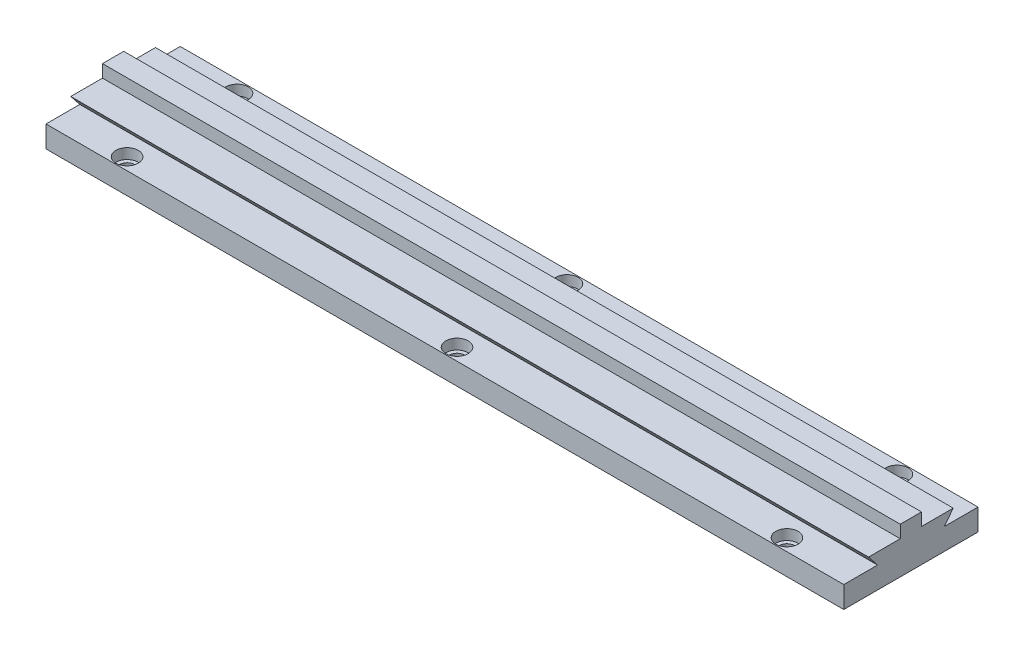
ISO-10303-21;
HEADER;
FILE_DESCRIPTION(('STEP AP214'),'2;1');
FILE_NAME('part.step','',(''),(''),'','','');
FILE_SCHEMA(('AUTOMOTIVE_DESIGN { 1 0 10303 214 1 1 1 1 }'));
ENDSEC;
DATA;
#1=APPLICATION_CONTEXT('core data for automotive mechanical design processes');
#2=APPLICATION_PROTOCOL_DEFINITION('international standard','automotive_design',2000,#1);
#3=PRODUCT_CONTEXT('',#1,'mechanical');
#4=PRODUCT('Part','Part','',(#3));
#5=PRODUCT_RELATED_PRODUCT_CATEGORY('part','',(#4));
#6=PRODUCT_DEFINITION_FORMATION('','',#4);
#7=PRODUCT_DEFINITION_CONTEXT('part definition',#1,'design');
#8=PRODUCT_DEFINITION('design','',#6,#7);
#9=PRODUCT_DEFINITION_SHAPE('','',#8);
#10=(LENGTH_UNIT() NAMED_UNIT(*) SI_UNIT(.MILLI.,.METRE.));
#11=(NAMED_UNIT(*) PLANE_ANGLE_UNIT() SI_UNIT($,.RADIAN.));
#12=(NAMED_UNIT(*) SI_UNIT($,.STERADIAN.) SOLID_ANGLE_UNIT());
#13=UNCERTAINTY_MEASURE_WITH_UNIT(LENGTH_MEASURE(1.E-05),#10,'distance_accuracy_value','');
#14=(GEOMETRIC_REPRESENTATION_CONTEXT(3) GLOBAL_UNCERTAINTY_ASSIGNED_CONTEXT((#13)) GLOBAL_UNIT_ASSIGNED_CONTEXT((#10,
#11,#12)) REPRESENTATION_CONTEXT('',''));
#15=CARTESIAN_POINT('',(0.,0.,0.));
#16=DIRECTION('',(0.,0.,1.));
#17=DIRECTION('',(1.,0.,0.));
#18=AXIS2_PLACEMENT_3D('',#15,#16,#17);
#19=CARTESIAN_POINT('',(368.5,10.,-31.));
#20=DIRECTION('',(0.,-1.,0.));
#21=DIRECTION('',(0.,0.,-1.));
#22=AXIS2_PLACEMENT_3D('',#19,#20,#21);
#23=PLANE('',#22);
#24=CARTESIAN_POINT('',(184.25,10.,-25.4));
#25=DIRECTION('',(0.,1.,0.));
#26=DIRECTION('',(0.,0.,1.));
#27=AXIS2_PLACEMENT_3D('',#24,#25,#26);
#28=CIRCLE('',#27,5.15873999999999);
#29=CARTESIAN_POINT('',(184.25,10.,-20.24126));
#30=VERTEX_POINT('',#29);
#31=EDGE_CURVE('E348',#30,#30,#28,.T.);
#32=ORIENTED_EDGE('',*,*,#31,.F.);
#33=EDGE_LOOP('',(#32));
#34=FACE_BOUND('',#33,.T.);
#35=CARTESIAN_POINT('',(336.65,10.,-25.4));
#36=DIRECTION('',(0.,1.,0.));
#37=DIRECTION('',(0.,0.,1.));
#38=AXIS2_PLACEMENT_3D('',#35,#36,#37);
#39=CIRCLE('',#38,5.15873999999999);
#40=CARTESIAN_POINT('',(336.65,10.,-20.24126));
#41=VERTEX_POINT('',#40);
#42=EDGE_CURVE('E338',#41,#41,#39,.T.);
#43=ORIENTED_EDGE('',*,*,#42,.F.);
#44=EDGE_LOOP('',(#43));
#45=FACE_BOUND('',#44,.T.);
#46=DIRECTION('',(0.,0.,1.));
#47=VECTOR('',#46,1.);
#48=CARTESIAN_POINT('',(0.,10.,-31.));
#49=LINE('',#48,#47);
#50=CARTESIAN_POINT('',(0.,10.,-31.));
#51=VERTEX_POINT('',#50);
#52=CARTESIAN_POINT('',(0.,10.,-15.4));
#53=VERTEX_POINT('',#52);
#54=EDGE_CURVE('E163',#51,#53,#49,.T.);
#55=ORIENTED_EDGE('',*,*,#54,.T.);
#56=DIRECTION('',(-1.,0.,0.));
#57=VECTOR('',#56,1.);
#58=CARTESIAN_POINT('',(368.5,10.,-15.4));
#59=LINE('',#58,#57);
#60=CARTESIAN_POINT('',(368.5,10.,-15.4));
#61=VERTEX_POINT('',#60);
#62=EDGE_CURVE('E194',#61,#53,#59,.T.);
#63=ORIENTED_EDGE('',*,*,#62,.F.);
#64=DIRECTION('',(0.,0.,1.));
#65=VECTOR('',#64,1.);
#66=CARTESIAN_POINT('',(368.5,10.,-31.));
#67=LINE('',#66,#65);
#68=CARTESIAN_POINT('',(368.5,10.,-31.));
#69=VERTEX_POINT('',#68);
#70=EDGE_CURVE('E223',#69,#61,#67,.T.);
#71=ORIENTED_EDGE('',*,*,#70,.F.);
#72=DIRECTION('',(-1.,0.,0.));
#73=VECTOR('',#72,1.);
#74=CARTESIAN_POINT('',(368.5,10.,-31.));
#75=LINE('',#74,#73);
#76=EDGE_CURVE('E197',#69,#51,#75,.T.);
#77=ORIENTED_EDGE('',*,*,#76,.T.);
#78=EDGE_LOOP('',(#55,#63,#71,#77));
#79=FACE_BOUND('',#78,.T.);
#80=CARTESIAN_POINT('',(31.85,10.,-25.4));
#81=DIRECTION('',(0.,1.,0.));
#82=DIRECTION('',(0.,0.,1.));
#83=AXIS2_PLACEMENT_3D('',#80,#81,#82);
#84=CIRCLE('',#83,5.15873999999999);
#85=CARTESIAN_POINT('',(31.85,10.,-20.24126));
#86=VERTEX_POINT('',#85);
#87=EDGE_CURVE('E358',#86,#86,#84,.T.);
#88=ORIENTED_EDGE('',*,*,#87,.F.);
#89=EDGE_LOOP('',(#88));
#90=FACE_BOUND('',#89,.T.);
#91=ADVANCED_FACE('F34',(#34,#45,#79,#90),#23,.F.);
#92=CARTESIAN_POINT('',(368.5,0.,31.));
#93=DIRECTION('',(0.,0.,-1.));
#94=DIRECTION('',(-1.,0.,0.));
#95=AXIS2_PLACEMENT_3D('',#92,#93,#94);
#96=PLANE('',#95);
#97=DIRECTION('',(0.,-1.,0.));
#98=VECTOR('',#97,1.);
#99=CARTESIAN_POINT('',(0.,0.,31.));
#100=LINE('',#99,#98);
#101=CARTESIAN_POINT('',(0.,10.,31.));
#102=VERTEX_POINT('',#101);
#103=CARTESIAN_POINT('',(0.,0.,31.));
#104=VERTEX_POINT('',#103);
#105=EDGE_CURVE('E155',#102,#104,#100,.T.);
#106=ORIENTED_EDGE('',*,*,#105,.T.);
#107=DIRECTION('',(-1.,0.,0.));
#108=VECTOR('',#107,1.);
#109=CARTESIAN_POINT('',(368.5,0.,31.));
#110=LINE('',#109,#108);
#111=CARTESIAN_POINT('',(368.5,0.,31.));
#112=VERTEX_POINT('',#111);
#113=EDGE_CURVE('E11',#112,#104,#110,.T.);
#114=ORIENTED_EDGE('',*,*,#113,.F.);
#115=DIRECTION('',(0.,-1.,0.));
#116=VECTOR('',#115,1.);
#117=CARTESIAN_POINT('',(368.5,0.,31.));
#118=LINE('',#117,#116);
#119=CARTESIAN_POINT('',(368.5,10.,31.));
#120=VERTEX_POINT('',#119);
#121=EDGE_CURVE('E178',#120,#112,#118,.T.);
#122=ORIENTED_EDGE('',*,*,#121,.F.);
#123=DIRECTION('',(-1.,0.,0.));
#124=VECTOR('',#123,1.);
#125=CARTESIAN_POINT('',(368.5,10.,31.));
#126=LINE('',#125,#124);
#127=EDGE_CURVE('E151',#120,#102,#126,.T.);
#128=ORIENTED_EDGE('',*,*,#127,.T.);
#129=EDGE_LOOP('',(#106,#114,#122,#128));
#130=FACE_BOUND('',#129,.T.);
#131=ADVANCED_FACE('F36',(#130),#96,.F.);
#132=CARTESIAN_POINT('',(368.5,0.,31.));
#133=DIRECTION('',(0.,1.,0.));
#134=DIRECTION('',(0.,0.,1.));
#135=AXIS2_PLACEMENT_3D('',#132,#133,#134);
#136=PLANE('',#135);
#137=CARTESIAN_POINT('',(31.85,0.,-25.4));
#138=DIRECTION('',(0.,1.,0.));
#139=DIRECTION('',(0.,0.,1.));
#140=AXIS2_PLACEMENT_3D('',#137,#138,#139);
#141=CIRCLE('',#140,3.3782);
#142=CARTESIAN_POINT('',(31.85,0.,-22.0218));
#143=VERTEX_POINT('',#142);
#144=EDGE_CURVE('E278',#143,#143,#141,.T.);
#145=ORIENTED_EDGE('',*,*,#144,.T.);
#146=EDGE_LOOP('',(#145));
#147=FACE_BOUND('',#146,.T.);
#148=CARTESIAN_POINT('',(184.25,0.,-25.4));
#149=DIRECTION('',(0.,1.,0.));
#150=DIRECTION('',(0.,0.,1.));
#151=AXIS2_PLACEMENT_3D('',#148,#149,#150);
#152=CIRCLE('',#151,3.3782);
#153=CARTESIAN_POINT('',(184.25,0.,-22.0218));
#154=VERTEX_POINT('',#153);
#155=EDGE_CURVE('E282',#154,#154,#152,.T.);
#156=ORIENTED_EDGE('',*,*,#155,.T.);
#157=EDGE_LOOP('',(#156));
#158=FACE_BOUND('',#157,.T.);
#159=CARTESIAN_POINT('',(336.65,0.,-25.4));
#160=DIRECTION('',(0.,1.,0.));
#161=DIRECTION('',(0.,0.,1.));
#162=AXIS2_PLACEMENT_3D('',#159,#160,#161);
#163=CIRCLE('',#162,3.3782);
#164=CARTESIAN_POINT('',(336.65,0.,-22.0218));
#165=VERTEX_POINT('',#164);
#166=EDGE_CURVE('E286',#165,#165,#163,.T.);
#167=ORIENTED_EDGE('',*,*,#166,.T.);
#168=EDGE_LOOP('',(#167));
#169=FACE_BOUND('',#168,.T.);
#170=CARTESIAN_POINT('',(336.65,0.,25.4));
#171=DIRECTION('',(0.,1.,0.));
#172=DIRECTION('',(0.,0.,1.));
#173=AXIS2_PLACEMENT_3D('',#170,#171,#172);
#174=CIRCLE('',#173,3.3782);
#175=CARTESIAN_POINT('',(336.65,0.,28.7782));
#176=VERTEX_POINT('',#175);
#177=EDGE_CURVE('E290',#176,#176,#174,.T.);
#178=ORIENTED_EDGE('',*,*,#177,.T.);
#179=EDGE_LOOP('',(#178));
#180=FACE_BOUND('',#179,.T.);
#181=CARTESIAN_POINT('',(184.25,0.,25.4));
#182=DIRECTION('',(0.,1.,0.));
#183=DIRECTION('',(0.,0.,1.));
#184=AXIS2_PLACEMENT_3D('',#181,#182,#183);
#185=CIRCLE('',#184,3.3782);
#186=CARTESIAN_POINT('',(184.25,0.,28.7782));
#187=VERTEX_POINT('',#186);
#188=EDGE_CURVE('E294',#187,#187,#185,.T.);
#189=ORIENTED_EDGE('',*,*,#188,.T.);
#190=EDGE_LOOP('',(#189));
#191=FACE_BOUND('',#190,.T.);
#192=CARTESIAN_POINT('',(31.85,0.,25.4));
#193=DIRECTION('',(0.,1.,0.));
#194=DIRECTION('',(0.,0.,1.));
#195=AXIS2_PLACEMENT_3D('',#192,#193,#194);
#196=CIRCLE('',#195,3.3782);
#197=CARTESIAN_POINT('',(31.85,0.,28.7782));
#198=VERTEX_POINT('',#197);
#199=EDGE_CURVE('E159',#198,#198,#196,.T.);
#200=ORIENTED_EDGE('',*,*,#199,.T.);
#201=EDGE_LOOP('',(#200));
#202=FACE_BOUND('',#201,.T.);
#203=DIRECTION('',(0.,0.,-1.));
#204=VECTOR('',#203,1.);
#205=CARTESIAN_POINT('',(0.,0.,31.));
#206=LINE('',#205,#204);
#207=CARTESIAN_POINT('',(0.,0.,-31.));
#208=VERTEX_POINT('',#207);
#209=EDGE_CURVE('E158',#104,#208,#206,.T.);
#210=ORIENTED_EDGE('',*,*,#209,.T.);
#211=DIRECTION('',(-1.,0.,0.));
#212=VECTOR('',#211,1.);
#213=CARTESIAN_POINT('',(368.5,0.,-31.));
#214=LINE('',#213,#212);
#215=CARTESIAN_POINT('',(368.5,0.,-31.));
#216=VERTEX_POINT('',#215);
#217=EDGE_CURVE('E43',#216,#208,#214,.T.);
#218=ORIENTED_EDGE('',*,*,#217,.F.);
#219=DIRECTION('',(0.,0.,-1.));
#220=VECTOR('',#219,1.);
#221=CARTESIAN_POINT('',(368.5,0.,31.));
#222=LINE('',#221,#220);
#223=EDGE_CURVE('E106',#112,#216,#222,.T.);
#224=ORIENTED_EDGE('',*,*,#223,.F.);
#225=ORIENTED_EDGE('',*,*,#113,.T.);
#226=EDGE_LOOP('',(#210,#218,#224,#225));
#227=FACE_BOUND('',#226,.T.);
#228=ADVANCED_FACE('F264',(#147,#158,#169,#180,#191,#202,#227),#136,.F.);
#229=CARTESIAN_POINT('',(368.5,0.,-31.));
#230=DIRECTION('',(0.,0.,1.));
#231=DIRECTION('',(1.,0.,0.));
#232=AXIS2_PLACEMENT_3D('',#229,#230,#231);
#233=PLANE('',#232);
#234=DIRECTION('',(0.,1.,0.));
#235=VECTOR('',#234,1.);
#236=CARTESIAN_POINT('',(0.,0.,-31.));
#237=LINE('',#236,#235);
#238=EDGE_CURVE('E161',#208,#51,#237,.T.);
#239=ORIENTED_EDGE('',*,*,#238,.T.);
#240=ORIENTED_EDGE('',*,*,#76,.F.);
#241=DIRECTION('',(0.,1.,0.));
#242=VECTOR('',#241,1.);
#243=CARTESIAN_POINT('',(368.5,0.,-31.));
#244=LINE('',#243,#242);
#245=EDGE_CURVE('E205',#216,#69,#244,.T.);
#246=ORIENTED_EDGE('',*,*,#245,.F.);
#247=ORIENTED_EDGE('',*,*,#217,.T.);
#248=EDGE_LOOP('',(#239,#240,#246,#247));
#249=FACE_BOUND('',#248,.T.);
#250=ADVANCED_FACE('F203',(#249),#233,.F.);
#251=CARTESIAN_POINT('',(368.5,10.,-15.4));
#252=DIRECTION('',(0.,0.619788850318609,0.784768616230757));
#253=DIRECTION('',(0.,-0.784768616230757,0.619788850318609));
#254=AXIS2_PLACEMENT_3D('',#251,#252,#253);
#255=PLANE('',#254);
#256=DIRECTION('',(0.,0.784768616230757,-0.619788850318609));
#257=VECTOR('',#256,1.);
#258=CARTESIAN_POINT('',(0.,10.,-15.4));
#259=LINE('',#258,#257);
#260=CARTESIAN_POINT('',(0.,15.28,-19.57));
#261=VERTEX_POINT('',#260);
#262=EDGE_CURVE('E165',#53,#261,#259,.T.);
#263=ORIENTED_EDGE('',*,*,#262,.T.);
#264=DIRECTION('',(-1.,0.,0.));
#265=VECTOR('',#264,1.);
#266=CARTESIAN_POINT('',(368.5,15.28,-19.57));
#267=LINE('',#266,#265);
#268=CARTESIAN_POINT('',(368.5,15.28,-19.57));
#269=VERTEX_POINT('',#268);
#270=EDGE_CURVE('E191',#269,#261,#267,.T.);
#271=ORIENTED_EDGE('',*,*,#270,.F.);
#272=DIRECTION('',(0.,0.784768616230757,-0.619788850318609));
#273=VECTOR('',#272,1.);
#274=CARTESIAN_POINT('',(368.5,10.,-15.4));
#275=LINE('',#274,#273);
#276=EDGE_CURVE('E220',#61,#269,#275,.T.);
#277=ORIENTED_EDGE('',*,*,#276,.F.);
#278=ORIENTED_EDGE('',*,*,#62,.T.);
#279=EDGE_LOOP('',(#263,#271,#277,#278));
#280=FACE_BOUND('',#279,.T.);
#281=ADVANCED_FACE('F218',(#280),#255,.F.);
#282=CARTESIAN_POINT('',(368.5,15.28,-4.91));
#283=DIRECTION('',(0.,-1.,0.));
#284=DIRECTION('',(0.,0.,-1.));
#285=AXIS2_PLACEMENT_3D('',#282,#283,#284);
#286=PLANE('',#285);
#287=DIRECTION('',(0.,0.,1.));
#288=VECTOR('',#287,1.);
#289=CARTESIAN_POINT('',(0.,15.28,-4.91));
#290=LINE('',#289,#288);
#291=CARTESIAN_POINT('',(0.,15.28,-4.91));
#292=VERTEX_POINT('',#291);
#293=EDGE_CURVE('E167',#261,#292,#290,.T.);
#294=ORIENTED_EDGE('',*,*,#293,.T.);
#295=DIRECTION('',(-1.,0.,0.));
#296=VECTOR('',#295,1.);
#297=CARTESIAN_POINT('',(368.5,15.28,-4.91));
#298=LINE('',#297,#296);
#299=CARTESIAN_POINT('',(368.5,15.28,-4.91));
#300=VERTEX_POINT('',#299);
#301=EDGE_CURVE('E188',#300,#292,#298,.T.);
#302=ORIENTED_EDGE('',*,*,#301,.F.);
#303=DIRECTION('',(0.,0.,1.));
#304=VECTOR('',#303,1.);
#305=CARTESIAN_POINT('',(368.5,15.28,-4.91));
#306=LINE('',#305,#304);
#307=EDGE_CURVE('E222',#269,#300,#306,.T.);
#308=ORIENTED_EDGE('',*,*,#307,.F.);
#309=ORIENTED_EDGE('',*,*,#270,.T.);
#310=EDGE_LOOP('',(#294,#302,#308,#309));
#311=FACE_BOUND('',#310,.T.);
#312=ADVANCED_FACE('F608',(#311),#286,.F.);
#313=CARTESIAN_POINT('',(368.5,15.28,-4.91));
#314=DIRECTION('',(0.,0.,1.));
#315=DIRECTION('',(0.,-1.,0.));
#316=AXIS2_PLACEMENT_3D('',#313,#314,#315);
#317=PLANE('',#316);
#318=DIRECTION('',(0.,1.,0.));
#319=VECTOR('',#318,1.);
#320=CARTESIAN_POINT('',(0.,15.28,-4.91));
#321=LINE('',#320,#319);
#322=CARTESIAN_POINT('',(0.,21.1,-4.91));
#323=VERTEX_POINT('',#322);
#324=EDGE_CURVE('E169',#292,#323,#321,.T.);
#325=ORIENTED_EDGE('',*,*,#324,.T.);
#326=DIRECTION('',(-1.,0.,0.));
#327=VECTOR('',#326,1.);
#328=CARTESIAN_POINT('',(368.5,21.1,-4.91));
#329=LINE('',#328,#327);
#330=CARTESIAN_POINT('',(368.5,21.1,-4.91));
#331=VERTEX_POINT('',#330);
#332=EDGE_CURVE('E185',#331,#323,#329,.T.);
#333=ORIENTED_EDGE('',*,*,#332,.F.);
#334=DIRECTION('',(0.,1.,0.));
#335=VECTOR('',#334,1.);
#336=CARTESIAN_POINT('',(368.5,15.28,-4.91));
#337=LINE('',#336,#335);
#338=EDGE_CURVE('E225',#300,#331,#337,.T.);
#339=ORIENTED_EDGE('',*,*,#338,.F.);
#340=ORIENTED_EDGE('',*,*,#301,.T.);
#341=EDGE_LOOP('',(#325,#333,#339,#340));
#342=FACE_BOUND('',#341,.T.);
#343=ADVANCED_FACE('F600',(#342),#317,.F.);
#344=CARTESIAN_POINT('',(368.5,21.1,4.91));
#345=DIRECTION('',(0.,-1.,0.));
#346=DIRECTION('',(0.,0.,-1.));
#347=AXIS2_PLACEMENT_3D('',#344,#345,#346);
#348=PLANE('',#347);
#349=DIRECTION('',(0.,0.,1.));
#350=VECTOR('',#349,1.);
#351=CARTESIAN_POINT('',(0.,21.1,4.91));
#352=LINE('',#351,#350);
#353=CARTESIAN_POINT('',(0.,21.1,4.91));
#354=VERTEX_POINT('',#353);
#355=EDGE_CURVE('E171',#323,#354,#352,.T.);
#356=ORIENTED_EDGE('',*,*,#355,.T.);
#357=DIRECTION('',(-1.,0.,0.));
#358=VECTOR('',#357,1.);
#359=CARTESIAN_POINT('',(368.5,21.1,4.91));
#360=LINE('',#359,#358);
#361=CARTESIAN_POINT('',(368.5,21.1,4.91));
#362=VERTEX_POINT('',#361);
#363=EDGE_CURVE('E182',#362,#354,#360,.T.);
#364=ORIENTED_EDGE('',*,*,#363,.F.);
#365=DIRECTION('',(0.,0.,1.));
#366=VECTOR('',#365,1.);
#367=CARTESIAN_POINT('',(368.5,21.1,4.91));
#368=LINE('',#367,#366);
#369=EDGE_CURVE('E231',#331,#362,#368,.T.);
#370=ORIENTED_EDGE('',*,*,#369,.F.);
#371=ORIENTED_EDGE('',*,*,#332,.T.);
#372=EDGE_LOOP('',(#356,#364,#370,#371));
#373=FACE_BOUND('',#372,.T.);
#374=ADVANCED_FACE('F237',(#373),#348,.F.);
#375=CARTESIAN_POINT('',(368.5,15.28,4.91));
#376=DIRECTION('',(0.,0.,-1.));
#377=DIRECTION('',(0.,1.,0.));
#378=AXIS2_PLACEMENT_3D('',#375,#376,#377);
#379=PLANE('',#378);
#380=DIRECTION('',(0.,-1.,0.));
#381=VECTOR('',#380,1.);
#382=CARTESIAN_POINT('',(0.,15.28,4.91));
#383=LINE('',#382,#381);
#384=CARTESIAN_POINT('',(0.,15.28,4.91));
#385=VERTEX_POINT('',#384);
#386=EDGE_CURVE('E173',#354,#385,#383,.T.);
#387=ORIENTED_EDGE('',*,*,#386,.T.);
#388=DIRECTION('',(-1.,0.,0.));
#389=VECTOR('',#388,1.);
#390=CARTESIAN_POINT('',(368.5,15.28,4.91));
#391=LINE('',#390,#389);
#392=CARTESIAN_POINT('',(368.5,15.28,4.91));
#393=VERTEX_POINT('',#392);
#394=EDGE_CURVE('E146',#393,#385,#391,.T.);
#395=ORIENTED_EDGE('',*,*,#394,.F.);
#396=DIRECTION('',(0.,-1.,0.));
#397=VECTOR('',#396,1.);
#398=CARTESIAN_POINT('',(368.5,15.28,4.91));
#399=LINE('',#398,#397);
#400=EDGE_CURVE('E137',#362,#393,#399,.T.);
#401=ORIENTED_EDGE('',*,*,#400,.F.);
#402=ORIENTED_EDGE('',*,*,#363,.T.);
#403=EDGE_LOOP('',(#387,#395,#401,#402));
#404=FACE_BOUND('',#403,.T.);
#405=ADVANCED_FACE('F241',(#404),#379,.F.);
#406=CARTESIAN_POINT('',(368.5,15.28,19.57));
#407=DIRECTION('',(0.,-1.,0.));
#408=DIRECTION('',(0.,0.,-1.));
#409=AXIS2_PLACEMENT_3D('',#406,#407,#408);
#410=PLANE('',#409);
#411=DIRECTION('',(0.,0.,1.));
#412=VECTOR('',#411,1.);
#413=CARTESIAN_POINT('',(0.,15.28,19.57));
#414=LINE('',#413,#412);
#415=CARTESIAN_POINT('',(0.,15.28,19.57));
#416=VERTEX_POINT('',#415);
#417=EDGE_CURVE('E145',#385,#416,#414,.T.);
#418=ORIENTED_EDGE('',*,*,#417,.T.);
#419=DIRECTION('',(-1.,0.,0.));
#420=VECTOR('',#419,1.);
#421=CARTESIAN_POINT('',(368.5,15.28,19.57));
#422=LINE('',#421,#420);
#423=CARTESIAN_POINT('',(368.5,15.28,19.57));
#424=VERTEX_POINT('',#423);
#425=EDGE_CURVE('E142',#424,#416,#422,.T.);
#426=ORIENTED_EDGE('',*,*,#425,.F.);
#427=DIRECTION('',(0.,0.,1.));
#428=VECTOR('',#427,1.);
#429=CARTESIAN_POINT('',(368.5,15.28,19.57));
#430=LINE('',#429,#428);
#431=EDGE_CURVE('E131',#393,#424,#430,.T.);
#432=ORIENTED_EDGE('',*,*,#431,.F.);
#433=ORIENTED_EDGE('',*,*,#394,.T.);
#434=EDGE_LOOP('',(#418,#426,#432,#433));
#435=FACE_BOUND('',#434,.T.);
#436=ADVANCED_FACE('F143',(#435),#410,.F.);
#437=CARTESIAN_POINT('',(368.5,10.,15.4));
#438=DIRECTION('',(0.,0.619788850318609,-0.784768616230757));
#439=DIRECTION('',(0.,0.784768616230757,0.619788850318609));
#440=AXIS2_PLACEMENT_3D('',#437,#438,#439);
#441=PLANE('',#440);
#442=DIRECTION('',(0.,-0.784768616230756,-0.619788850318609));
#443=VECTOR('',#442,1.);
#444=CARTESIAN_POINT('',(0.,10.,15.4));
#445=LINE('',#444,#443);
#446=CARTESIAN_POINT('',(0.,10.,15.4));
#447=VERTEX_POINT('',#446);
#448=EDGE_CURVE('E92',#416,#447,#445,.T.);
#449=ORIENTED_EDGE('',*,*,#448,.T.);
#450=DIRECTION('',(-1.,0.,0.));
#451=VECTOR('',#450,1.);
#452=CARTESIAN_POINT('',(368.5,10.,15.4));
#453=LINE('',#452,#451);
#454=CARTESIAN_POINT('',(368.5,10.,15.4));
#455=VERTEX_POINT('',#454);
#456=EDGE_CURVE('E147',#455,#447,#453,.T.);
#457=ORIENTED_EDGE('',*,*,#456,.F.);
#458=DIRECTION('',(0.,-0.784768616230756,-0.619788850318609));
#459=VECTOR('',#458,1.);
#460=CARTESIAN_POINT('',(368.5,10.,15.4));
#461=LINE('',#460,#459);
#462=EDGE_CURVE('E135',#424,#455,#461,.T.);
#463=ORIENTED_EDGE('',*,*,#462,.F.);
#464=ORIENTED_EDGE('',*,*,#425,.T.);
#465=EDGE_LOOP('',(#449,#457,#463,#464));
#466=FACE_BOUND('',#465,.T.);
#467=ADVANCED_FACE('F149',(#466),#441,.F.);
#468=CARTESIAN_POINT('',(368.5,10.,31.));
#469=DIRECTION('',(0.,-1.,0.));
#470=DIRECTION('',(0.,0.,-1.));
#471=AXIS2_PLACEMENT_3D('',#468,#469,#470);
#472=PLANE('',#471);
#473=CARTESIAN_POINT('',(336.65,9.99999999999999,25.4));
#474=DIRECTION('',(0.,1.,0.));
#475=DIRECTION('',(0.,0.,1.));
#476=AXIS2_PLACEMENT_3D('',#473,#474,#475);
#477=CIRCLE('',#476,5.15873999999999);
#478=CARTESIAN_POINT('',(336.65,9.99999999999999,30.55874));
#479=VERTEX_POINT('',#478);
#480=EDGE_CURVE('E328',#479,#479,#477,.T.);
#481=ORIENTED_EDGE('',*,*,#480,.F.);
#482=EDGE_LOOP('',(#481));
#483=FACE_BOUND('',#482,.T.);
#484=CARTESIAN_POINT('',(184.25,9.99999999999999,25.4));
#485=DIRECTION('',(0.,1.,0.));
#486=DIRECTION('',(0.,0.,1.));
#487=AXIS2_PLACEMENT_3D('',#484,#485,#486);
#488=CIRCLE('',#487,5.15873999999999);
#489=CARTESIAN_POINT('',(184.25,9.99999999999999,30.55874));
#490=VERTEX_POINT('',#489);
#491=EDGE_CURVE('E318',#490,#490,#488,.T.);
#492=ORIENTED_EDGE('',*,*,#491,.F.);
#493=EDGE_LOOP('',(#492));
#494=FACE_BOUND('',#493,.T.);
#495=CARTESIAN_POINT('',(31.85,9.99999999999999,25.4));
#496=DIRECTION('',(0.,1.,0.));
#497=DIRECTION('',(0.,0.,1.));
#498=AXIS2_PLACEMENT_3D('',#495,#496,#497);
#499=CIRCLE('',#498,5.15873999999999);
#500=CARTESIAN_POINT('',(31.85,9.99999999999999,30.55874));
#501=VERTEX_POINT('',#500);
#502=EDGE_CURVE('E308',#501,#501,#499,.T.);
#503=ORIENTED_EDGE('',*,*,#502,.F.);
#504=EDGE_LOOP('',(#503));
#505=FACE_BOUND('',#504,.T.);
#506=DIRECTION('',(0.,0.,1.));
#507=VECTOR('',#506,1.);
#508=CARTESIAN_POINT('',(0.,10.,31.));
#509=LINE('',#508,#507);
#510=EDGE_CURVE('E98',#447,#102,#509,.T.);
#511=ORIENTED_EDGE('',*,*,#510,.T.);
#512=ORIENTED_EDGE('',*,*,#127,.F.);
#513=DIRECTION('',(0.,0.,1.));
#514=VECTOR('',#513,1.);
#515=CARTESIAN_POINT('',(368.5,10.,31.));
#516=LINE('',#515,#514);
#517=EDGE_CURVE('E51',#455,#120,#516,.T.);
#518=ORIENTED_EDGE('',*,*,#517,.F.);
#519=ORIENTED_EDGE('',*,*,#456,.T.);
#520=EDGE_LOOP('',(#511,#512,#518,#519));
#521=FACE_BOUND('',#520,.T.);
#522=ADVANCED_FACE('F245',(#483,#494,#505,#521),#472,.F.);
#523=CARTESIAN_POINT('',(368.5,0.,0.));
#524=DIRECTION('',(-1.,0.,0.));
#525=DIRECTION('',(0.,0.,1.));
#526=AXIS2_PLACEMENT_3D('',#523,#524,#525);
#527=PLANE('',#526);
#528=ORIENTED_EDGE('',*,*,#121,.T.);
#529=ORIENTED_EDGE('',*,*,#223,.T.);
#530=ORIENTED_EDGE('',*,*,#245,.T.);
#531=ORIENTED_EDGE('',*,*,#70,.T.);
#532=ORIENTED_EDGE('',*,*,#276,.T.);
#533=ORIENTED_EDGE('',*,*,#307,.T.);
#534=ORIENTED_EDGE('',*,*,#338,.T.);
#535=ORIENTED_EDGE('',*,*,#369,.T.);
#536=ORIENTED_EDGE('',*,*,#400,.T.);
#537=ORIENTED_EDGE('',*,*,#431,.T.);
#538=ORIENTED_EDGE('',*,*,#462,.T.);
#539=ORIENTED_EDGE('',*,*,#517,.T.);
#540=EDGE_LOOP('',(#528,#529,#530,#531,#532,#533,#534,#535,#536,#537,#538,#539));
#541=FACE_BOUND('',#540,.T.);
#542=ADVANCED_FACE('F133',(#541),#527,.F.);
#543=CARTESIAN_POINT('',(0.,0.,0.));
#544=DIRECTION('',(-1.,0.,0.));
#545=DIRECTION('',(0.,0.,1.));
#546=AXIS2_PLACEMENT_3D('',#543,#544,#545);
#547=PLANE('',#546);
#548=ORIENTED_EDGE('',*,*,#105,.F.);
#549=ORIENTED_EDGE('',*,*,#510,.F.);
#550=ORIENTED_EDGE('',*,*,#448,.F.);
#551=ORIENTED_EDGE('',*,*,#417,.F.);
#552=ORIENTED_EDGE('',*,*,#386,.F.);
#553=ORIENTED_EDGE('',*,*,#355,.F.);
#554=ORIENTED_EDGE('',*,*,#324,.F.);
#555=ORIENTED_EDGE('',*,*,#293,.F.);
#556=ORIENTED_EDGE('',*,*,#262,.F.);
#557=ORIENTED_EDGE('',*,*,#54,.F.);
#558=ORIENTED_EDGE('',*,*,#238,.F.);
#559=ORIENTED_EDGE('',*,*,#209,.F.);
#560=EDGE_LOOP('',(#548,#549,#550,#551,#552,#553,#554,#555,#556,#557,#558,#559));
#561=FACE_BOUND('',#560,.T.);
#562=ADVANCED_FACE('F209',(#561),#547,.T.);
#563=CARTESIAN_POINT('',(31.85,9.99999999999999,25.4));
#564=DIRECTION('',(0.,1.,0.));
#565=DIRECTION('',(0.,0.,1.));
#566=AXIS2_PLACEMENT_3D('',#563,#564,#565);
#567=CYLINDRICAL_SURFACE('',#566,3.3782);
#568=ORIENTED_EDGE('',*,*,#199,.F.);
#569=EDGE_LOOP('',(#568));
#570=FACE_BOUND('',#569,.T.);
#571=CARTESIAN_POINT('',(31.85,5.2248,25.4));
#572=DIRECTION('',(0.,1.,0.));
#573=DIRECTION('',(0.,0.,1.));
#574=AXIS2_PLACEMENT_3D('',#571,#572,#573);
#575=CIRCLE('',#574,3.3782);
#576=CARTESIAN_POINT('',(31.85,5.2248,28.7782));
#577=VERTEX_POINT('',#576);
#578=EDGE_CURVE('E298',#577,#577,#575,.T.);
#579=ORIENTED_EDGE('',*,*,#578,.T.);
#580=EDGE_LOOP('',(#579));
#581=FACE_BOUND('',#580,.T.);
#582=ADVANCED_FACE('F433',(#570,#581),#567,.F.);
#583=CARTESIAN_POINT('',(35.2282,5.2248,25.4));
#584=DIRECTION('',(0.,-1.,0.));
#585=DIRECTION('',(0.,0.,-1.));
#586=AXIS2_PLACEMENT_3D('',#583,#584,#585);
#587=PLANE('',#586);
#588=ORIENTED_EDGE('',*,*,#578,.F.);
#589=EDGE_LOOP('',(#588));
#590=FACE_BOUND('',#589,.T.);
#591=CARTESIAN_POINT('',(31.85,5.2248,25.4));
#592=DIRECTION('',(0.,1.,0.));
#593=DIRECTION('',(0.,0.,1.));
#594=AXIS2_PLACEMENT_3D('',#591,#592,#593);
#595=CIRCLE('',#594,5.15873999999999);
#596=CARTESIAN_POINT('',(31.85,5.2248,30.55874));
#597=VERTEX_POINT('',#596);
#598=EDGE_CURVE('E301',#597,#597,#595,.T.);
#599=ORIENTED_EDGE('',*,*,#598,.T.);
#600=EDGE_LOOP('',(#599));
#601=FACE_BOUND('',#600,.T.);
#602=ADVANCED_FACE('F429',(#590,#601),#587,.F.);
#603=CARTESIAN_POINT('',(31.85,9.99999999999999,25.4));
#604=DIRECTION('',(0.,1.,0.));
#605=DIRECTION('',(0.,0.,1.));
#606=AXIS2_PLACEMENT_3D('',#603,#604,#605);
#607=CYLINDRICAL_SURFACE('',#606,5.15873999999999);
#608=ORIENTED_EDGE('',*,*,#598,.F.);
#609=EDGE_LOOP('',(#608));
#610=FACE_BOUND('',#609,.T.);
#611=ORIENTED_EDGE('',*,*,#502,.T.);
#612=EDGE_LOOP('',(#611));
#613=FACE_BOUND('',#612,.T.);
#614=ADVANCED_FACE('F425',(#610,#613),#607,.F.);
#615=CARTESIAN_POINT('',(184.25,9.99999999999999,25.4));
#616=DIRECTION('',(0.,1.,0.));
#617=DIRECTION('',(0.,0.,1.));
#618=AXIS2_PLACEMENT_3D('',#615,#616,#617);
#619=CYLINDRICAL_SURFACE('',#618,3.3782);
#620=ORIENTED_EDGE('',*,*,#188,.F.);
#621=EDGE_LOOP('',(#620));
#622=FACE_BOUND('',#621,.T.);
#623=CARTESIAN_POINT('',(184.25,5.2248,25.4));
#624=DIRECTION('',(0.,1.,0.));
#625=DIRECTION('',(0.,0.,1.));
#626=AXIS2_PLACEMENT_3D('',#623,#624,#625);
#627=CIRCLE('',#626,3.3782);
#628=CARTESIAN_POINT('',(184.25,5.2248,28.7782));
#629=VERTEX_POINT('',#628);
#630=EDGE_CURVE('E312',#629,#629,#627,.T.);
#631=ORIENTED_EDGE('',*,*,#630,.T.);
#632=EDGE_LOOP('',(#631));
#633=FACE_BOUND('',#632,.T.);
#634=ADVANCED_FACE('F421',(#622,#633),#619,.F.);
#635=CARTESIAN_POINT('',(187.6282,5.2248,25.4));
#636=DIRECTION('',(0.,-1.,0.));
#637=DIRECTION('',(0.,0.,-1.));
#638=AXIS2_PLACEMENT_3D('',#635,#636,#637);
#639=PLANE('',#638);
#640=ORIENTED_EDGE('',*,*,#630,.F.);
#641=EDGE_LOOP('',(#640));
#642=FACE_BOUND('',#641,.T.);
#643=CARTESIAN_POINT('',(184.25,5.2248,25.4));
#644=DIRECTION('',(0.,1.,0.));
#645=DIRECTION('',(0.,0.,1.));
#646=AXIS2_PLACEMENT_3D('',#643,#644,#645);
#647=CIRCLE('',#646,5.15873999999999);
#648=CARTESIAN_POINT('',(184.25,5.2248,30.55874));
#649=VERTEX_POINT('',#648);
#650=EDGE_CURVE('E315',#649,#649,#647,.T.);
#651=ORIENTED_EDGE('',*,*,#650,.T.);
#652=EDGE_LOOP('',(#651));
#653=FACE_BOUND('',#652,.T.);
#654=ADVANCED_FACE('F417',(#642,#653),#639,.F.);
#655=CARTESIAN_POINT('',(184.25,9.99999999999999,25.4));
#656=DIRECTION('',(0.,1.,0.));
#657=DIRECTION('',(0.,0.,1.));
#658=AXIS2_PLACEMENT_3D('',#655,#656,#657);
#659=CYLINDRICAL_SURFACE('',#658,5.15873999999999);
#660=ORIENTED_EDGE('',*,*,#650,.F.);
#661=EDGE_LOOP('',(#660));
#662=FACE_BOUND('',#661,.T.);
#663=ORIENTED_EDGE('',*,*,#491,.T.);
#664=EDGE_LOOP('',(#663));
#665=FACE_BOUND('',#664,.T.);
#666=ADVANCED_FACE('F413',(#662,#665),#659,.F.);
#667=CARTESIAN_POINT('',(336.65,9.99999999999999,25.4));
#668=DIRECTION('',(0.,1.,0.));
#669=DIRECTION('',(0.,0.,1.));
#670=AXIS2_PLACEMENT_3D('',#667,#668,#669);
#671=CYLINDRICAL_SURFACE('',#670,3.3782);
#672=ORIENTED_EDGE('',*,*,#177,.F.);
#673=EDGE_LOOP('',(#672));
#674=FACE_BOUND('',#673,.T.);
#675=CARTESIAN_POINT('',(336.65,5.2248,25.4));
#676=DIRECTION('',(0.,1.,0.));
#677=DIRECTION('',(0.,0.,1.));
#678=AXIS2_PLACEMENT_3D('',#675,#676,#677);
#679=CIRCLE('',#678,3.3782);
#680=CARTESIAN_POINT('',(336.65,5.2248,28.7782));
#681=VERTEX_POINT('',#680);
#682=EDGE_CURVE('E322',#681,#681,#679,.T.);
#683=ORIENTED_EDGE('',*,*,#682,.T.);
#684=EDGE_LOOP('',(#683));
#685=FACE_BOUND('',#684,.T.);
#686=ADVANCED_FACE('F409',(#674,#685),#671,.F.);
#687=CARTESIAN_POINT('',(340.0282,5.2248,25.4));
#688=DIRECTION('',(0.,-1.,0.));
#689=DIRECTION('',(0.,0.,-1.));
#690=AXIS2_PLACEMENT_3D('',#687,#688,#689);
#691=PLANE('',#690);
#692=ORIENTED_EDGE('',*,*,#682,.F.);
#693=EDGE_LOOP('',(#692));
#694=FACE_BOUND('',#693,.T.);
#695=CARTESIAN_POINT('',(336.65,5.2248,25.4));
#696=DIRECTION('',(0.,1.,0.));
#697=DIRECTION('',(0.,0.,1.));
#698=AXIS2_PLACEMENT_3D('',#695,#696,#697);
#699=CIRCLE('',#698,5.15873999999999);
#700=CARTESIAN_POINT('',(336.65,5.2248,30.55874));
#701=VERTEX_POINT('',#700);
#702=EDGE_CURVE('E325',#701,#701,#699,.T.);
#703=ORIENTED_EDGE('',*,*,#702,.T.);
#704=EDGE_LOOP('',(#703));
#705=FACE_BOUND('',#704,.T.);
#706=ADVANCED_FACE('F405',(#694,#705),#691,.F.);
#707=CARTESIAN_POINT('',(336.65,9.99999999999999,25.4));
#708=DIRECTION('',(0.,1.,0.));
#709=DIRECTION('',(0.,0.,1.));
#710=AXIS2_PLACEMENT_3D('',#707,#708,#709);
#711=CYLINDRICAL_SURFACE('',#710,5.15873999999999);
#712=ORIENTED_EDGE('',*,*,#702,.F.);
#713=EDGE_LOOP('',(#712));
#714=FACE_BOUND('',#713,.T.);
#715=ORIENTED_EDGE('',*,*,#480,.T.);
#716=EDGE_LOOP('',(#715));
#717=FACE_BOUND('',#716,.T.);
#718=ADVANCED_FACE('F401',(#714,#717),#711,.F.);
#719=CARTESIAN_POINT('',(336.65,10.,-25.4));
#720=DIRECTION('',(0.,1.,0.));
#721=DIRECTION('',(0.,0.,1.));
#722=AXIS2_PLACEMENT_3D('',#719,#720,#721);
#723=CYLINDRICAL_SURFACE('',#722,3.3782);
#724=ORIENTED_EDGE('',*,*,#166,.F.);
#725=EDGE_LOOP('',(#724));
#726=FACE_BOUND('',#725,.T.);
#727=CARTESIAN_POINT('',(336.65,5.22480000000001,-25.4));
#728=DIRECTION('',(0.,1.,0.));
#729=DIRECTION('',(0.,0.,1.));
#730=AXIS2_PLACEMENT_3D('',#727,#728,#729);
#731=CIRCLE('',#730,3.3782);
#732=CARTESIAN_POINT('',(336.65,5.22480000000001,-22.0218));
#733=VERTEX_POINT('',#732);
#734=EDGE_CURVE('E332',#733,#733,#731,.T.);
#735=ORIENTED_EDGE('',*,*,#734,.T.);
#736=EDGE_LOOP('',(#735));
#737=FACE_BOUND('',#736,.T.);
#738=ADVANCED_FACE('F397',(#726,#737),#723,.F.);
#739=CARTESIAN_POINT('',(340.0282,5.22480000000001,-25.4));
#740=DIRECTION('',(0.,-1.,0.));
#741=DIRECTION('',(0.,0.,-1.));
#742=AXIS2_PLACEMENT_3D('',#739,#740,#741);
#743=PLANE('',#742);
#744=ORIENTED_EDGE('',*,*,#734,.F.);
#745=EDGE_LOOP('',(#744));
#746=FACE_BOUND('',#745,.T.);
#747=CARTESIAN_POINT('',(336.65,5.22480000000001,-25.4));
#748=DIRECTION('',(0.,1.,0.));
#749=DIRECTION('',(0.,0.,1.));
#750=AXIS2_PLACEMENT_3D('',#747,#748,#749);
#751=CIRCLE('',#750,5.15873999999999);
#752=CARTESIAN_POINT('',(336.65,5.22480000000001,-20.24126));
#753=VERTEX_POINT('',#752);
#754=EDGE_CURVE('E335',#753,#753,#751,.T.);
#755=ORIENTED_EDGE('',*,*,#754,.T.);
#756=EDGE_LOOP('',(#755));
#757=FACE_BOUND('',#756,.T.);
#758=ADVANCED_FACE('F393',(#746,#757),#743,.F.);
#759=CARTESIAN_POINT('',(336.65,10.,-25.4));
#760=DIRECTION('',(0.,1.,0.));
#761=DIRECTION('',(0.,0.,1.));
#762=AXIS2_PLACEMENT_3D('',#759,#760,#761);
#763=CYLINDRICAL_SURFACE('',#762,5.15873999999999);
#764=ORIENTED_EDGE('',*,*,#754,.F.);
#765=EDGE_LOOP('',(#764));
#766=FACE_BOUND('',#765,.T.);
#767=ORIENTED_EDGE('',*,*,#42,.T.);
#768=EDGE_LOOP('',(#767));
#769=FACE_BOUND('',#768,.T.);
#770=ADVANCED_FACE('F389',(#766,#769),#763,.F.);
#771=CARTESIAN_POINT('',(184.25,10.,-25.4));
#772=DIRECTION('',(0.,1.,0.));
#773=DIRECTION('',(0.,0.,1.));
#774=AXIS2_PLACEMENT_3D('',#771,#772,#773);
#775=CYLINDRICAL_SURFACE('',#774,3.3782);
#776=ORIENTED_EDGE('',*,*,#155,.F.);
#777=EDGE_LOOP('',(#776));
#778=FACE_BOUND('',#777,.T.);
#779=CARTESIAN_POINT('',(184.25,5.22480000000001,-25.4));
#780=DIRECTION('',(0.,1.,0.));
#781=DIRECTION('',(0.,0.,1.));
#782=AXIS2_PLACEMENT_3D('',#779,#780,#781);
#783=CIRCLE('',#782,3.3782);
#784=CARTESIAN_POINT('',(184.25,5.22480000000001,-22.0218));
#785=VERTEX_POINT('',#784);
#786=EDGE_CURVE('E342',#785,#785,#783,.T.);
#787=ORIENTED_EDGE('',*,*,#786,.T.);
#788=EDGE_LOOP('',(#787));
#789=FACE_BOUND('',#788,.T.);
#790=ADVANCED_FACE('F385',(#778,#789),#775,.F.);
#791=CARTESIAN_POINT('',(187.6282,5.22480000000001,-25.4));
#792=DIRECTION('',(0.,-1.,0.));
#793=DIRECTION('',(0.,0.,-1.));
#794=AXIS2_PLACEMENT_3D('',#791,#792,#793);
#795=PLANE('',#794);
#796=ORIENTED_EDGE('',*,*,#786,.F.);
#797=EDGE_LOOP('',(#796));
#798=FACE_BOUND('',#797,.T.);
#799=CARTESIAN_POINT('',(184.25,5.22480000000001,-25.4));
#800=DIRECTION('',(0.,1.,0.));
#801=DIRECTION('',(0.,0.,1.));
#802=AXIS2_PLACEMENT_3D('',#799,#800,#801);
#803=CIRCLE('',#802,5.15873999999999);
#804=CARTESIAN_POINT('',(184.25,5.22480000000001,-20.24126));
#805=VERTEX_POINT('',#804);
#806=EDGE_CURVE('E345',#805,#805,#803,.T.);
#807=ORIENTED_EDGE('',*,*,#806,.T.);
#808=EDGE_LOOP('',(#807));
#809=FACE_BOUND('',#808,.T.);
#810=ADVANCED_FACE('F381',(#798,#809),#795,.F.);
#811=CARTESIAN_POINT('',(184.25,10.,-25.4));
#812=DIRECTION('',(0.,1.,0.));
#813=DIRECTION('',(0.,0.,1.));
#814=AXIS2_PLACEMENT_3D('',#811,#812,#813);
#815=CYLINDRICAL_SURFACE('',#814,5.15873999999999);
#816=ORIENTED_EDGE('',*,*,#806,.F.);
#817=EDGE_LOOP('',(#816));
#818=FACE_BOUND('',#817,.T.);
#819=ORIENTED_EDGE('',*,*,#31,.T.);
#820=EDGE_LOOP('',(#819));
#821=FACE_BOUND('',#820,.T.);
#822=ADVANCED_FACE('F377',(#818,#821),#815,.F.);
#823=CARTESIAN_POINT('',(31.85,10.,-25.4));
#824=DIRECTION('',(0.,1.,0.));
#825=DIRECTION('',(0.,0.,1.));
#826=AXIS2_PLACEMENT_3D('',#823,#824,#825);
#827=CYLINDRICAL_SURFACE('',#826,3.3782);
#828=ORIENTED_EDGE('',*,*,#144,.F.);
#829=EDGE_LOOP('',(#828));
#830=FACE_BOUND('',#829,.T.);
#831=CARTESIAN_POINT('',(31.85,5.22480000000001,-25.4));
#832=DIRECTION('',(0.,1.,0.));
#833=DIRECTION('',(0.,0.,1.));
#834=AXIS2_PLACEMENT_3D('',#831,#832,#833);
#835=CIRCLE('',#834,3.3782);
#836=CARTESIAN_POINT('',(31.85,5.22480000000001,-22.0218));
#837=VERTEX_POINT('',#836);
#838=EDGE_CURVE('E352',#837,#837,#835,.T.);
#839=ORIENTED_EDGE('',*,*,#838,.T.);
#840=EDGE_LOOP('',(#839));
#841=FACE_BOUND('',#840,.T.);
#842=ADVANCED_FACE('F370',(#830,#841),#827,.F.);
#843=CARTESIAN_POINT('',(35.2282,5.22480000000001,-25.4));
#844=DIRECTION('',(0.,-1.,0.));
#845=DIRECTION('',(0.,0.,-1.));
#846=AXIS2_PLACEMENT_3D('',#843,#844,#845);
#847=PLANE('',#846);
#848=ORIENTED_EDGE('',*,*,#838,.F.);
#849=EDGE_LOOP('',(#848));
#850=FACE_BOUND('',#849,.T.);
#851=CARTESIAN_POINT('',(31.85,5.22480000000001,-25.4));
#852=DIRECTION('',(0.,1.,0.));
#853=DIRECTION('',(0.,0.,1.));
#854=AXIS2_PLACEMENT_3D('',#851,#852,#853);
#855=CIRCLE('',#854,5.15873999999999);
#856=CARTESIAN_POINT('',(31.85,5.22480000000001,-20.24126));
#857=VERTEX_POINT('',#856);
#858=EDGE_CURVE('E355',#857,#857,#855,.T.);
#859=ORIENTED_EDGE('',*,*,#858,.T.);
#860=EDGE_LOOP('',(#859));
#861=FACE_BOUND('',#860,.T.);
#862=ADVANCED_FACE('F364',(#850,#861),#847,.F.);
#863=CARTESIAN_POINT('',(31.85,10.,-25.4));
#864=DIRECTION('',(0.,1.,0.));
#865=DIRECTION('',(0.,0.,1.));
#866=AXIS2_PLACEMENT_3D('',#863,#864,#865);
#867=CYLINDRICAL_SURFACE('',#866,5.15873999999999);
#868=ORIENTED_EDGE('',*,*,#858,.F.);
#869=EDGE_LOOP('',(#868));
#870=FACE_BOUND('',#869,.T.);
#871=ORIENTED_EDGE('',*,*,#87,.T.);
#872=EDGE_LOOP('',(#871));
#873=FACE_BOUND('',#872,.T.);
#874=ADVANCED_FACE('F362',(#870,#873),#867,.F.);
#875=CLOSED_SHELL('',(#91,#131,#228,#250,#281,#312,#343,#374,#405,#436,#467,#522,#542,#562,#582,
#602,#614,#634,#654,#666,#686,#706,#718,#738,#758,#770,#790,#810,#822,#842,#862,#874));
#876=MANIFOLD_SOLID_BREP('B2',#875);
#877=ADVANCED_BREP_SHAPE_REPRESENTATION('',(#18,#876),#14);
#878=SHAPE_DEFINITION_REPRESENTATION(#9,#877);
ENDSEC;
END-ISO-10303-21;
